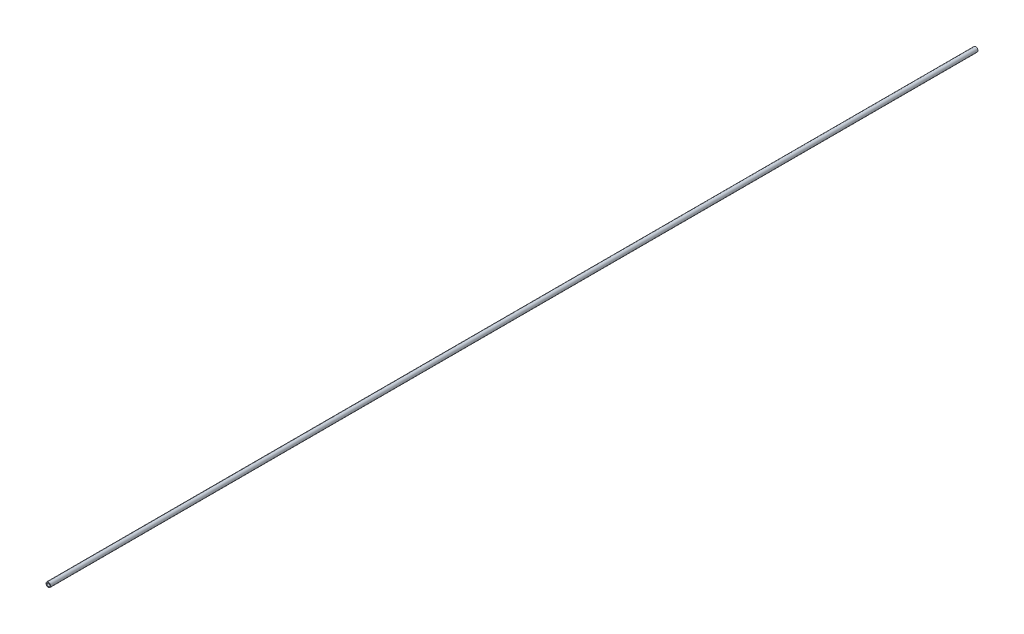
ISO-10303-21;
HEADER;
FILE_DESCRIPTION(('STEP AP214'),'2;1');
FILE_NAME('part.step','',(''),(''),'','','');
FILE_SCHEMA(('AUTOMOTIVE_DESIGN { 1 0 10303 214 1 1 1 1 }'));
ENDSEC;
DATA;
#1=APPLICATION_CONTEXT('core data for automotive mechanical design processes');
#2=APPLICATION_PROTOCOL_DEFINITION('international standard','automotive_design',2000,#1);
#3=PRODUCT_CONTEXT('',#1,'mechanical');
#4=PRODUCT('Part','Part','',(#3));
#5=PRODUCT_RELATED_PRODUCT_CATEGORY('part','',(#4));
#6=PRODUCT_DEFINITION_FORMATION('','',#4);
#7=PRODUCT_DEFINITION_CONTEXT('part definition',#1,'design');
#8=PRODUCT_DEFINITION('design','',#6,#7);
#9=PRODUCT_DEFINITION_SHAPE('','',#8);
#10=(LENGTH_UNIT() NAMED_UNIT(*) SI_UNIT(.MILLI.,.METRE.));
#11=(NAMED_UNIT(*) PLANE_ANGLE_UNIT() SI_UNIT($,.RADIAN.));
#12=(NAMED_UNIT(*) SI_UNIT($,.STERADIAN.) SOLID_ANGLE_UNIT());
#13=UNCERTAINTY_MEASURE_WITH_UNIT(LENGTH_MEASURE(1.E-05),#10,'distance_accuracy_value','');
#14=(GEOMETRIC_REPRESENTATION_CONTEXT(3) GLOBAL_UNCERTAINTY_ASSIGNED_CONTEXT((#13)) GLOBAL_UNIT_ASSIGNED_CONTEXT((#10,
#11,#12)) REPRESENTATION_CONTEXT('',''));
#15=CARTESIAN_POINT('',(0.,0.,0.));
#16=DIRECTION('',(0.,0.,1.));
#17=DIRECTION('',(1.,0.,0.));
#18=AXIS2_PLACEMENT_3D('',#15,#16,#17);
#19=CARTESIAN_POINT('',(0.,0.,1000.));
#20=DIRECTION('',(0.,0.,1.));
#21=DIRECTION('',(1.,0.,0.));
#22=AXIS2_PLACEMENT_3D('',#19,#20,#21);
#23=PLANE('',#22);
#24=CARTESIAN_POINT('',(0.,0.,1000.));
#25=DIRECTION('',(0.,0.,1.));
#26=DIRECTION('',(1.,0.,0.));
#27=AXIS2_PLACEMENT_3D('',#24,#25,#26);
#28=CIRCLE('',#27,2.5);
#29=CARTESIAN_POINT('',(2.5,0.,1000.));
#30=VERTEX_POINT('',#29);
#31=EDGE_CURVE('E10',#30,#30,#28,.T.);
#32=ORIENTED_EDGE('',*,*,#31,.T.);
#33=EDGE_LOOP('',(#32));
#34=FACE_BOUND('',#33,.T.);
#35=CARTESIAN_POINT('',(0.,0.,1000.));
#36=DIRECTION('',(0.,0.,1.));
#37=DIRECTION('',(1.,0.,0.));
#38=AXIS2_PLACEMENT_3D('',#35,#36,#37);
#39=CIRCLE('',#38,1.6);
#40=CARTESIAN_POINT('',(1.6,0.,1000.));
#41=VERTEX_POINT('',#40);
#42=EDGE_CURVE('E42',#41,#41,#39,.T.);
#43=ORIENTED_EDGE('',*,*,#42,.F.);
#44=EDGE_LOOP('',(#43));
#45=FACE_BOUND('',#44,.T.);
#46=ADVANCED_FACE('F31',(#34,#45),#23,.T.);
#47=CARTESIAN_POINT('',(0.,0.,0.));
#48=DIRECTION('',(0.,0.,1.));
#49=DIRECTION('',(1.,0.,0.));
#50=AXIS2_PLACEMENT_3D('',#47,#48,#49);
#51=PLANE('',#50);
#52=CARTESIAN_POINT('',(0.,0.,0.));
#53=DIRECTION('',(0.,0.,1.));
#54=DIRECTION('',(1.,0.,0.));
#55=AXIS2_PLACEMENT_3D('',#52,#53,#54);
#56=CIRCLE('',#55,2.5);
#57=CARTESIAN_POINT('',(2.5,0.,0.));
#58=VERTEX_POINT('',#57);
#59=EDGE_CURVE('E35',#58,#58,#56,.T.);
#60=ORIENTED_EDGE('',*,*,#59,.F.);
#61=EDGE_LOOP('',(#60));
#62=FACE_BOUND('',#61,.T.);
#63=CARTESIAN_POINT('',(0.,0.,0.));
#64=DIRECTION('',(0.,0.,1.));
#65=DIRECTION('',(1.,0.,0.));
#66=AXIS2_PLACEMENT_3D('',#63,#64,#65);
#67=CIRCLE('',#66,1.6);
#68=CARTESIAN_POINT('',(1.6,0.,0.));
#69=VERTEX_POINT('',#68);
#70=EDGE_CURVE('E44',#69,#69,#67,.T.);
#71=ORIENTED_EDGE('',*,*,#70,.T.);
#72=EDGE_LOOP('',(#71));
#73=FACE_BOUND('',#72,.T.);
#74=ADVANCED_FACE('F54',(#62,#73),#51,.F.);
#75=CARTESIAN_POINT('',(0.,0.,1000.));
#76=DIRECTION('',(0.,0.,-1.));
#77=DIRECTION('',(-1.,0.,0.));
#78=AXIS2_PLACEMENT_3D('',#75,#76,#77);
#79=CYLINDRICAL_SURFACE('',#78,2.5);
#80=ORIENTED_EDGE('',*,*,#31,.F.);
#81=EDGE_LOOP('',(#80));
#82=FACE_BOUND('',#81,.T.);
#83=ORIENTED_EDGE('',*,*,#59,.T.);
#84=EDGE_LOOP('',(#83));
#85=FACE_BOUND('',#84,.T.);
#86=ADVANCED_FACE('F33',(#82,#85),#79,.T.);
#87=CARTESIAN_POINT('',(0.,0.,1000.));
#88=DIRECTION('',(0.,0.,-1.));
#89=DIRECTION('',(-1.,0.,0.));
#90=AXIS2_PLACEMENT_3D('',#87,#88,#89);
#91=CYLINDRICAL_SURFACE('',#90,1.6);
#92=ORIENTED_EDGE('',*,*,#42,.T.);
#93=EDGE_LOOP('',(#92));
#94=FACE_BOUND('',#93,.T.);
#95=ORIENTED_EDGE('',*,*,#70,.F.);
#96=EDGE_LOOP('',(#95));
#97=FACE_BOUND('',#96,.T.);
#98=ADVANCED_FACE('F50',(#94,#97),#91,.F.);
#99=CLOSED_SHELL('',(#46,#74,#86,#98));
#100=MANIFOLD_SOLID_BREP('B2',#99);
#101=ADVANCED_BREP_SHAPE_REPRESENTATION('',(#18,#100),#14);
#102=SHAPE_DEFINITION_REPRESENTATION(#9,#101);
ENDSEC;
END-ISO-10303-21;
